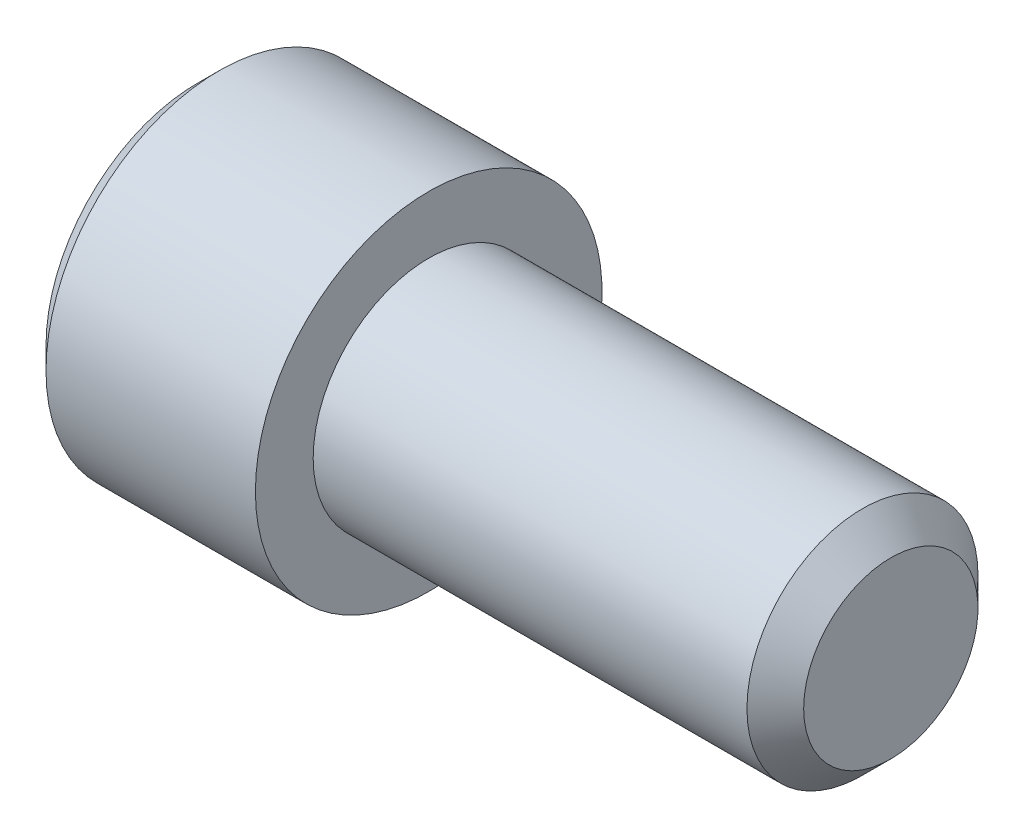
ISO-10303-21;
HEADER;
FILE_DESCRIPTION(('STEP AP214'),'2;1');
FILE_NAME('part.step','',(''),(''),'','','');
FILE_SCHEMA(('AUTOMOTIVE_DESIGN { 1 0 10303 214 1 1 1 1 }'));
ENDSEC;
DATA;
#1=APPLICATION_CONTEXT('core data for automotive mechanical design processes');
#2=APPLICATION_PROTOCOL_DEFINITION('international standard','automotive_design',2000,#1);
#3=PRODUCT_CONTEXT('',#1,'mechanical');
#4=PRODUCT('Part','Part','',(#3));
#5=PRODUCT_RELATED_PRODUCT_CATEGORY('part','',(#4));
#6=PRODUCT_DEFINITION_FORMATION('','',#4);
#7=PRODUCT_DEFINITION_CONTEXT('part definition',#1,'design');
#8=PRODUCT_DEFINITION('design','',#6,#7);
#9=PRODUCT_DEFINITION_SHAPE('','',#8);
#10=(LENGTH_UNIT() NAMED_UNIT(*) SI_UNIT(.MILLI.,.METRE.));
#11=(NAMED_UNIT(*) PLANE_ANGLE_UNIT() SI_UNIT($,.RADIAN.));
#12=(NAMED_UNIT(*) SI_UNIT($,.STERADIAN.) SOLID_ANGLE_UNIT());
#13=UNCERTAINTY_MEASURE_WITH_UNIT(LENGTH_MEASURE(1.E-05),#10,'distance_accuracy_value','');
#14=(GEOMETRIC_REPRESENTATION_CONTEXT(3) GLOBAL_UNCERTAINTY_ASSIGNED_CONTEXT((#13)) GLOBAL_UNIT_ASSIGNED_CONTEXT((#10,
#11,#12)) REPRESENTATION_CONTEXT('',''));
#15=CARTESIAN_POINT('',(0.,0.,0.));
#16=DIRECTION('',(0.,0.,1.));
#17=DIRECTION('',(1.,0.,0.));
#18=AXIS2_PLACEMENT_3D('',#15,#16,#17);
#19=CARTESIAN_POINT('',(-1.85,0.,0.));
#20=DIRECTION('',(-1.,0.,0.));
#21=DIRECTION('',(0.,0.,1.));
#22=AXIS2_PLACEMENT_3D('',#19,#20,#21);
#23=CONICAL_SURFACE('',#22,0.75,0.785398163397448);
#24=CARTESIAN_POINT('',(-2.,0.,0.));
#25=DIRECTION('',(-1.,0.,0.));
#26=DIRECTION('',(0.,0.,1.));
#27=AXIS2_PLACEMENT_3D('',#24,#25,#26);
#28=CIRCLE('',#27,0.9);
#29=CARTESIAN_POINT('',(-2.,0.,0.9));
#30=VERTEX_POINT('',#29);
#31=EDGE_CURVE('E226',#30,#30,#28,.T.);
#32=ORIENTED_EDGE('',*,*,#31,.T.);
#33=EDGE_LOOP('',(#32));
#34=FACE_BOUND('',#33,.T.);
#35=CARTESIAN_POINT('',(-1.96614089692921,0.866140873838278,-0.0002));
#36=CARTESIAN_POINT('',(-1.95125951424836,0.85125103201321,0.0255899625576815));
#37=CARTESIAN_POINT('',(-1.9372516693914,0.83611219228842,0.0518112021286592));
#38=CARTESIAN_POINT('',(-1.9116029284667,0.80524213589435,0.105279708235706));
#39=CARTESIAN_POINT('',(-1.89997631549011,0.789507978959821,0.132532067460573));
#40=CARTESIAN_POINT('',(-1.88005944955668,0.757780686272654,0.187485350381353));
#41=CARTESIAN_POINT('',(-1.87171909786581,0.741795643459148,0.21517225669551));
#42=CARTESIAN_POINT('',(-1.85886814574587,0.709473647943368,0.271155595130853));
#43=CARTESIAN_POINT('',(-1.85434794437328,0.693137683900543,0.299450314843645));
#44=CARTESIAN_POINT('',(-1.85027123688187,0.664986099540475,0.348210289268844));
#45=CARTESIAN_POINT('',(-1.84966820039852,0.653207128451651,0.368612065655573));
#46=CARTESIAN_POINT('',(-1.85067990979997,0.629671982217687,0.40937613469636));
#47=CARTESIAN_POINT('',(-1.85229514477447,0.617915812672248,0.429738417651455));
#48=CARTESIAN_POINT('',(-1.86036155075748,0.582815153286452,0.490534543086824));
#49=CARTESIAN_POINT('',(-1.87003433961216,0.559645329552699,0.530665854996099));
#50=CARTESIAN_POINT('',(-1.89338172175675,0.518974152327359,0.601110400354026));
#51=CARTESIAN_POINT('',(-1.90583396185669,0.501282308923486,0.631753572009086));
#52=CARTESIAN_POINT('',(-1.9338850140153,0.466591771248069,0.69183934580479));
#53=CARTESIAN_POINT('',(-1.94947358968819,0.449591032904757,0.721285488381591));
#54=CARTESIAN_POINT('',(-1.96614089692921,0.432897231838382,0.7502));
#55=B_SPLINE_CURVE_WITH_KNOTS('',3,(#35,#36,#37,#38,#39,#40,#41,#42,#43,#44,#45,#46,#47,#48,#49,
#50,#51,#52,#53,#54),.UNSPECIFIED.,.F.,.F.,(4,2,2,2,2,2,2,2,2,4),(0.,0.0999419466095598,
0.200466857654446,0.299393763705718,0.398071297300231,0.468665775681748,0.53927582139884,
0.680536257244566,0.792918418368074,0.904939568716032),.UNSPECIFIED.);
#56=CARTESIAN_POINT('',(-1.96602540378444,0.86602540378444,0.));
#57=VERTEX_POINT('',#56);
#58=CARTESIAN_POINT('',(-1.96602540378444,0.43301270189222,0.75));
#59=VERTEX_POINT('',#58);
#60=EDGE_CURVE('E54',#57,#59,#55,.T.);
#61=ORIENTED_EDGE('',*,*,#60,.T.);
#62=CARTESIAN_POINT('',(-2.28498450539523,-0.917435707843764,0.75));
#63=CARTESIAN_POINT('',(-2.2678667108574,-0.895322637488462,0.75));
#64=CARTESIAN_POINT('',(-2.25090072767686,-0.873092435797409,0.75));
#65=CARTESIAN_POINT('',(-2.21733662385259,-0.828348331249561,0.75));
#66=CARTESIAN_POINT('',(-2.20073858866413,-0.805834364354332,0.75));
#67=CARTESIAN_POINT('',(-2.15135585709605,-0.737463645985081,0.75));
#68=CARTESIAN_POINT('',(-2.11924462594972,-0.691112526673733,0.75));
#69=CARTESIAN_POINT('',(-2.05568682596992,-0.593551125551393,0.75));
#70=CARTESIAN_POINT('',(-2.02442165720724,-0.542221451270677,0.75));
#71=CARTESIAN_POINT('',(-1.96687568450647,-0.436934399168266,0.75));
#72=CARTESIAN_POINT('',(-1.94057804705966,-0.382986703868344,0.75));
#73=CARTESIAN_POINT('',(-1.90839074036174,-0.302507607984157,0.75));
#74=CARTESIAN_POINT('',(-1.89924982674428,-0.277284063785511,0.75));
#75=CARTESIAN_POINT('',(-1.88298812399052,-0.226180863902708,0.75));
#76=CARTESIAN_POINT('',(-1.87586746044888,-0.20030116753587,0.75));
#77=CARTESIAN_POINT('',(-1.86415365084109,-0.148504398457123,0.75));
#78=CARTESIAN_POINT('',(-1.85951333869583,-0.122598170477208,0.75));
#79=CARTESIAN_POINT('',(-1.85285693649874,-0.070440295072611,0.75));
#80=CARTESIAN_POINT('',(-1.85084110928875,-0.0441886133166744,0.75));
#81=CARTESIAN_POINT('',(-1.84961537614473,0.00715979592785976,0.75));
#82=CARTESIAN_POINT('',(-1.85027949049467,0.0322535332763837,0.75));
#83=CARTESIAN_POINT('',(-1.85408395670594,0.082242672718766,0.75));
#84=CARTESIAN_POINT('',(-1.85722369361662,0.107138122516666,0.75));
#85=CARTESIAN_POINT('',(-1.86585263917875,0.156986366361875,0.75));
#86=CARTESIAN_POINT('',(-1.87138423328569,0.181931702819942,0.75));
#87=CARTESIAN_POINT('',(-1.88448687025693,0.231269085182803,0.75));
#88=CARTESIAN_POINT('',(-1.89205781682589,0.255661157153014,0.75));
#89=CARTESIAN_POINT('',(-1.91810014054592,0.330191673605323,0.75));
#90=CARTESIAN_POINT('',(-1.93943977214851,0.379324631470661,0.75));
#91=CARTESIAN_POINT('',(-1.98693832469846,0.475298904003308,0.75));
#92=CARTESIAN_POINT('',(-2.01311412250561,0.522131443026563,0.75));
#93=CARTESIAN_POINT('',(-2.06717247921482,0.611659319459457,0.75));
#94=CARTESIAN_POINT('',(-2.09490758962535,0.654444829936083,0.75));
#95=CARTESIAN_POINT('',(-2.13780794830858,0.717480249811218,0.75));
#96=CARTESIAN_POINT('',(-2.15226421085697,0.738221190091019,0.75));
#97=CARTESIAN_POINT('',(-2.18156559351443,0.779418304292079,0.75));
#98=CARTESIAN_POINT('',(-2.19641060589534,0.799874554748216,0.75));
#99=CARTESIAN_POINT('',(-2.21141700400184,0.820212019409876,0.75));
#100=B_SPLINE_CURVE_WITH_KNOTS('',3,(#62,#63,#64,#65,#66,#67,#68,#69,#70,#71,#72,#73,#74,#75,
#76,#77,#78,#79,#80,#81,#82,#83,#84,#85,#86,#87,#88,#89,#90,#91,#92,#93,#94,#95,#96,#97,#98,
#99),.UNSPECIFIED.,.F.,.F.,(4,2,2,2,2,2,2,2,2,2,2,2,2,2,2,2,2,2,4),(0.,0.083891166922223,
0.167801617506669,0.336896584417538,0.517070724437731,0.696622901565622,0.77704232374542,
0.857466744334747,0.936301883451218,1.01514491728988,1.09032587205516,1.16548815756962,
1.24204077046884,1.31858976929581,1.47882432997554,1.63962900434597,1.79251782144892,
1.86836026980847,1.94418191901598),.UNSPECIFIED.);
#101=CARTESIAN_POINT('',(-1.96602540378444,-0.43301270189222,0.75));
#102=VERTEX_POINT('',#101);
#103=EDGE_CURVE('E196',#59,#102,#100,.F.);
#104=ORIENTED_EDGE('',*,*,#103,.T.);
#105=CARTESIAN_POINT('',(-1.96614089692921,-0.432897231838382,0.7502));
#106=CARTESIAN_POINT('',(-1.95125951424836,-0.44778707366345,0.724410037442319));
#107=CARTESIAN_POINT('',(-1.9372516693914,-0.462925913388239,0.698188797871341));
#108=CARTESIAN_POINT('',(-1.9116029284667,-0.49379596978231,0.644720291764294));
#109=CARTESIAN_POINT('',(-1.89997631549011,-0.509530126716839,0.617467932539428));
#110=CARTESIAN_POINT('',(-1.88005944955668,-0.541257419404005,0.562514649618648));
#111=CARTESIAN_POINT('',(-1.87171909786581,-0.557242462217511,0.534827743304491));
#112=CARTESIAN_POINT('',(-1.85886814574587,-0.589564457733291,0.478844404869148));
#113=CARTESIAN_POINT('',(-1.85434794437328,-0.605900421776116,0.450549685156356));
#114=CARTESIAN_POINT('',(-1.85027123688187,-0.634052006136184,0.401789710731158));
#115=CARTESIAN_POINT('',(-1.84966820039852,-0.645830977225008,0.381387934344429));
#116=CARTESIAN_POINT('',(-1.85067990979997,-0.669366123458972,0.340623865303642));
#117=CARTESIAN_POINT('',(-1.85229514477447,-0.681122293004411,0.320261582348547));
#118=CARTESIAN_POINT('',(-1.86036155075748,-0.716222952390207,0.259465456913178));
#119=CARTESIAN_POINT('',(-1.87003433961216,-0.73939277612396,0.219334145003903));
#120=CARTESIAN_POINT('',(-1.89338172175675,-0.7800639533493,0.148889599645976));
#121=CARTESIAN_POINT('',(-1.90583396185669,-0.797755796753174,0.118246427990915));
#122=CARTESIAN_POINT('',(-1.9338850140153,-0.83244633442859,0.0581606541952108));
#123=CARTESIAN_POINT('',(-1.94947358968819,-0.849447072771903,0.0287145116184096));
#124=CARTESIAN_POINT('',(-1.96614089692921,-0.866140873838278,-0.000199999999999989));
#125=B_SPLINE_CURVE_WITH_KNOTS('',3,(#105,#106,#107,#108,#109,#110,#111,#112,#113,#114,#115,
#116,#117,#118,#119,#120,#121,#122,#123,#124),.UNSPECIFIED.,.F.,.F.,(4,2,2,2,2,2,2,2,2,4),(0.,
0.0999419466095593,0.200466857654446,0.299393763705716,0.398071297300229,0.468665775681746,
0.539275821398837,0.680536257244564,0.792918418368073,0.904939568716032),.UNSPECIFIED.);
#126=CARTESIAN_POINT('',(-1.96602540378444,-0.86602540378444,0.));
#127=VERTEX_POINT('',#126);
#128=EDGE_CURVE('E140',#102,#127,#125,.T.);
#129=ORIENTED_EDGE('',*,*,#128,.T.);
#130=CARTESIAN_POINT('',(-1.96614089692921,-0.866140873838278,0.0002));
#131=CARTESIAN_POINT('',(-1.95125951424836,-0.85125103201321,-0.0255899625576815));
#132=CARTESIAN_POINT('',(-1.9372516693914,-0.83611219228842,-0.0518112021286592));
#133=CARTESIAN_POINT('',(-1.9116029284667,-0.80524213589435,-0.105279708235706));
#134=CARTESIAN_POINT('',(-1.89997631549011,-0.789507978959821,-0.132532067460573));
#135=CARTESIAN_POINT('',(-1.88005944955668,-0.757780686272654,-0.187485350381353));
#136=CARTESIAN_POINT('',(-1.87171909786581,-0.741795643459148,-0.21517225669551));
#137=CARTESIAN_POINT('',(-1.85886814574587,-0.709473647943368,-0.271155595130853));
#138=CARTESIAN_POINT('',(-1.85434794437328,-0.693137683900543,-0.299450314843645));
#139=CARTESIAN_POINT('',(-1.85027123688187,-0.664986099540475,-0.348210289268844));
#140=CARTESIAN_POINT('',(-1.84966820039852,-0.653207128451651,-0.368612065655573));
#141=CARTESIAN_POINT('',(-1.85067990979997,-0.629671982217687,-0.40937613469636));
#142=CARTESIAN_POINT('',(-1.85229514477447,-0.617915812672248,-0.429738417651455));
#143=CARTESIAN_POINT('',(-1.86036155075748,-0.582815153286452,-0.490534543086824));
#144=CARTESIAN_POINT('',(-1.87003433961216,-0.559645329552699,-0.530665854996099));
#145=CARTESIAN_POINT('',(-1.89338172175675,-0.518974152327359,-0.601110400354026));
#146=CARTESIAN_POINT('',(-1.90583396185669,-0.501282308923486,-0.631753572009086));
#147=CARTESIAN_POINT('',(-1.9338850140153,-0.466591771248069,-0.69183934580479));
#148=CARTESIAN_POINT('',(-1.94947358968819,-0.449591032904757,-0.721285488381591));
#149=CARTESIAN_POINT('',(-1.96614089692921,-0.432897231838382,-0.7502));
#150=B_SPLINE_CURVE_WITH_KNOTS('',3,(#130,#131,#132,#133,#134,#135,#136,#137,#138,#139,#140,
#141,#142,#143,#144,#145,#146,#147,#148,#149),.UNSPECIFIED.,.F.,.F.,(4,2,2,2,2,2,2,2,2,4),(0.,
0.0999419466095598,0.200466857654446,0.299393763705718,0.398071297300231,0.468665775681748,
0.53927582139884,0.680536257244566,0.792918418368074,0.904939568716032),.UNSPECIFIED.);
#151=CARTESIAN_POINT('',(-1.96602540378444,-0.43301270189222,-0.75));
#152=VERTEX_POINT('',#151);
#153=EDGE_CURVE('E187',#127,#152,#150,.T.);
#154=ORIENTED_EDGE('',*,*,#153,.T.);
#155=CARTESIAN_POINT('',(-2.28498450539523,-0.917435707843764,-0.75));
#156=CARTESIAN_POINT('',(-2.2678667108574,-0.895322637488462,-0.75));
#157=CARTESIAN_POINT('',(-2.25090072767686,-0.873092435797409,-0.75));
#158=CARTESIAN_POINT('',(-2.21733662385259,-0.828348331249561,-0.75));
#159=CARTESIAN_POINT('',(-2.20073858866413,-0.805834364354332,-0.75));
#160=CARTESIAN_POINT('',(-2.15135585709605,-0.737463645985081,-0.75));
#161=CARTESIAN_POINT('',(-2.11924462594972,-0.691112526673733,-0.75));
#162=CARTESIAN_POINT('',(-2.05568682596992,-0.593551125551393,-0.75));
#163=CARTESIAN_POINT('',(-2.02442165720724,-0.542221451270677,-0.75));
#164=CARTESIAN_POINT('',(-1.96687568450647,-0.436934399168266,-0.75));
#165=CARTESIAN_POINT('',(-1.94057804705966,-0.382986703868344,-0.75));
#166=CARTESIAN_POINT('',(-1.90839074036174,-0.302507607984157,-0.75));
#167=CARTESIAN_POINT('',(-1.89924982674428,-0.277284063785511,-0.75));
#168=CARTESIAN_POINT('',(-1.88298812399052,-0.226180863902708,-0.75));
#169=CARTESIAN_POINT('',(-1.87586746044888,-0.20030116753587,-0.75));
#170=CARTESIAN_POINT('',(-1.86415365084109,-0.148504398457123,-0.75));
#171=CARTESIAN_POINT('',(-1.85951333869583,-0.122598170477208,-0.75));
#172=CARTESIAN_POINT('',(-1.85285693649874,-0.070440295072611,-0.75));
#173=CARTESIAN_POINT('',(-1.85084110928875,-0.0441886133166744,-0.75));
#174=CARTESIAN_POINT('',(-1.84961537614473,0.00715979592785976,-0.75));
#175=CARTESIAN_POINT('',(-1.85027949049467,0.0322535332763837,-0.75));
#176=CARTESIAN_POINT('',(-1.85408395670594,0.082242672718766,-0.75));
#177=CARTESIAN_POINT('',(-1.85722369361662,0.107138122516666,-0.75));
#178=CARTESIAN_POINT('',(-1.86585263917875,0.156986366361875,-0.75));
#179=CARTESIAN_POINT('',(-1.87138423328569,0.181931702819942,-0.75));
#180=CARTESIAN_POINT('',(-1.88448687025693,0.231269085182803,-0.75));
#181=CARTESIAN_POINT('',(-1.89205781682589,0.255661157153014,-0.75));
#182=CARTESIAN_POINT('',(-1.91810014054592,0.330191673605323,-0.75));
#183=CARTESIAN_POINT('',(-1.93943977214851,0.379324631470661,-0.75));
#184=CARTESIAN_POINT('',(-1.98693832469846,0.475298904003308,-0.75));
#185=CARTESIAN_POINT('',(-2.01311412250561,0.522131443026563,-0.75));
#186=CARTESIAN_POINT('',(-2.06717247921482,0.611659319459457,-0.75));
#187=CARTESIAN_POINT('',(-2.09490758962535,0.654444829936083,-0.75));
#188=CARTESIAN_POINT('',(-2.13780794830858,0.717480249811218,-0.75));
#189=CARTESIAN_POINT('',(-2.15226421085697,0.738221190091019,-0.75));
#190=CARTESIAN_POINT('',(-2.18156559351443,0.779418304292079,-0.75));
#191=CARTESIAN_POINT('',(-2.19641060589534,0.799874554748216,-0.75));
#192=CARTESIAN_POINT('',(-2.21141700400184,0.820212019409876,-0.75));
#193=B_SPLINE_CURVE_WITH_KNOTS('',3,(#155,#156,#157,#158,#159,#160,#161,#162,#163,#164,#165,
#166,#167,#168,#169,#170,#171,#172,#173,#174,#175,#176,#177,#178,#179,#180,#181,#182,#183,#184,
#185,#186,#187,#188,#189,#190,#191,#192),.UNSPECIFIED.,.F.,.F.,(4,2,2,2,2,2,2,2,2,2,2,2,2,2,2,2,
2,2,4),(0.,0.083891166922223,0.167801617506669,0.336896584417538,0.517070724437731,
0.696622901565622,0.77704232374542,0.857466744334747,0.936301883451218,1.01514491728988,
1.09032587205516,1.16548815756962,1.24204077046884,1.31858976929581,1.47882432997554,
1.63962900434597,1.79251782144892,1.86836026980847,1.94418191901598),.UNSPECIFIED.);
#194=CARTESIAN_POINT('',(-1.96602540378444,0.43301270189222,-0.75));
#195=VERTEX_POINT('',#194);
#196=EDGE_CURVE('E182',#152,#195,#193,.T.);
#197=ORIENTED_EDGE('',*,*,#196,.T.);
#198=CARTESIAN_POINT('',(-1.96614089692921,0.432897231838382,-0.7502));
#199=CARTESIAN_POINT('',(-1.95125951424836,0.44778707366345,-0.724410037442319));
#200=CARTESIAN_POINT('',(-1.9372516693914,0.462925913388239,-0.698188797871341));
#201=CARTESIAN_POINT('',(-1.9116029284667,0.49379596978231,-0.644720291764294));
#202=CARTESIAN_POINT('',(-1.89997631549011,0.509530126716839,-0.617467932539428));
#203=CARTESIAN_POINT('',(-1.88005944955668,0.541257419404005,-0.562514649618648));
#204=CARTESIAN_POINT('',(-1.87171909786581,0.557242462217511,-0.534827743304491));
#205=CARTESIAN_POINT('',(-1.85886814574587,0.589564457733291,-0.478844404869148));
#206=CARTESIAN_POINT('',(-1.85434794437328,0.605900421776116,-0.450549685156356));
#207=CARTESIAN_POINT('',(-1.85027123688187,0.634052006136184,-0.401789710731158));
#208=CARTESIAN_POINT('',(-1.84966820039852,0.645830977225008,-0.381387934344429));
#209=CARTESIAN_POINT('',(-1.85067990979997,0.669366123458972,-0.340623865303642));
#210=CARTESIAN_POINT('',(-1.85229514477447,0.681122293004411,-0.320261582348547));
#211=CARTESIAN_POINT('',(-1.86036155075748,0.716222952390207,-0.259465456913178));
#212=CARTESIAN_POINT('',(-1.87003433961216,0.73939277612396,-0.219334145003903));
#213=CARTESIAN_POINT('',(-1.89338172175675,0.7800639533493,-0.148889599645976));
#214=CARTESIAN_POINT('',(-1.90583396185669,0.797755796753174,-0.118246427990915));
#215=CARTESIAN_POINT('',(-1.9338850140153,0.83244633442859,-0.0581606541952108));
#216=CARTESIAN_POINT('',(-1.94947358968819,0.849447072771903,-0.0287145116184096));
#217=CARTESIAN_POINT('',(-1.96614089692921,0.866140873838278,0.000199999999999989));
#218=B_SPLINE_CURVE_WITH_KNOTS('',3,(#198,#199,#200,#201,#202,#203,#204,#205,#206,#207,#208,
#209,#210,#211,#212,#213,#214,#215,#216,#217),.UNSPECIFIED.,.F.,.F.,(4,2,2,2,2,2,2,2,2,4),(0.,
0.0999419466095593,0.200466857654446,0.299393763705716,0.398071297300229,0.468665775681746,
0.539275821398837,0.680536257244564,0.792918418368073,0.904939568716032),.UNSPECIFIED.);
#219=EDGE_CURVE('E143',#195,#57,#218,.T.);
#220=ORIENTED_EDGE('',*,*,#219,.T.);
#221=EDGE_LOOP('',(#61,#104,#129,#154,#197,#220));
#222=FACE_BOUND('',#221,.T.);
#223=ADVANCED_FACE('F39',(#34,#222),#23,.F.);
#224=CARTESIAN_POINT('',(-2.,0.,0.));
#225=DIRECTION('',(1.,0.,0.));
#226=DIRECTION('',(0.,0.,-1.));
#227=AXIS2_PLACEMENT_3D('',#224,#225,#226);
#228=PLANE('',#227);
#229=CARTESIAN_POINT('',(-2.,0.,0.));
#230=DIRECTION('',(-1.,0.,0.));
#231=DIRECTION('',(0.,0.,1.));
#232=AXIS2_PLACEMENT_3D('',#229,#230,#231);
#233=CIRCLE('',#232,1.3125);
#234=CARTESIAN_POINT('',(-2.,0.,1.3125));
#235=VERTEX_POINT('',#234);
#236=EDGE_CURVE('E11',#235,#235,#233,.T.);
#237=ORIENTED_EDGE('',*,*,#236,.T.);
#238=EDGE_LOOP('',(#237));
#239=FACE_BOUND('',#238,.T.);
#240=ORIENTED_EDGE('',*,*,#31,.F.);
#241=EDGE_LOOP('',(#240));
#242=FACE_BOUND('',#241,.T.);
#243=ADVANCED_FACE('F41',(#239,#242),#228,.F.);
#244=CARTESIAN_POINT('',(-1.8125,0.,0.));
#245=DIRECTION('',(1.,0.,0.));
#246=DIRECTION('',(0.,0.,-1.));
#247=AXIS2_PLACEMENT_3D('',#244,#245,#246);
#248=CONICAL_SURFACE('',#247,1.5,0.785398163397448);
#249=ORIENTED_EDGE('',*,*,#236,.F.);
#250=EDGE_LOOP('',(#249));
#251=FACE_BOUND('',#250,.T.);
#252=CARTESIAN_POINT('',(-1.8125,0.,0.));
#253=DIRECTION('',(-1.,0.,0.));
#254=DIRECTION('',(0.,0.,1.));
#255=AXIS2_PLACEMENT_3D('',#252,#253,#254);
#256=CIRCLE('',#255,1.5);
#257=CARTESIAN_POINT('',(-1.8125,0.,1.5));
#258=VERTEX_POINT('',#257);
#259=EDGE_CURVE('E47',#258,#258,#256,.T.);
#260=ORIENTED_EDGE('',*,*,#259,.T.);
#261=EDGE_LOOP('',(#260));
#262=FACE_BOUND('',#261,.T.);
#263=ADVANCED_FACE('F222',(#251,#262),#248,.T.);
#264=CARTESIAN_POINT('',(4.,0.,0.));
#265=DIRECTION('',(-1.,0.,0.));
#266=DIRECTION('',(0.,0.,1.));
#267=AXIS2_PLACEMENT_3D('',#264,#265,#266);
#268=CYLINDRICAL_SURFACE('',#267,1.5);
#269=ORIENTED_EDGE('',*,*,#259,.F.);
#270=EDGE_LOOP('',(#269));
#271=FACE_BOUND('',#270,.T.);
#272=CARTESIAN_POINT('',(0.,0.,0.));
#273=DIRECTION('',(-1.,0.,0.));
#274=DIRECTION('',(0.,0.,1.));
#275=AXIS2_PLACEMENT_3D('',#272,#273,#274);
#276=CIRCLE('',#275,1.5);
#277=CARTESIAN_POINT('',(0.,0.,1.5));
#278=VERTEX_POINT('',#277);
#279=EDGE_CURVE('E241',#278,#278,#276,.T.);
#280=ORIENTED_EDGE('',*,*,#279,.T.);
#281=EDGE_LOOP('',(#280));
#282=FACE_BOUND('',#281,.T.);
#283=ADVANCED_FACE('F247',(#271,#282),#268,.T.);
#284=CARTESIAN_POINT('',(0.,1.5,0.));
#285=DIRECTION('',(-1.,0.,0.));
#286=DIRECTION('',(0.,0.,1.));
#287=AXIS2_PLACEMENT_3D('',#284,#285,#286);
#288=PLANE('',#287);
#289=ORIENTED_EDGE('',*,*,#279,.F.);
#290=EDGE_LOOP('',(#289));
#291=FACE_BOUND('',#290,.T.);
#292=CARTESIAN_POINT('',(0.,0.,0.));
#293=DIRECTION('',(-1.,0.,0.));
#294=DIRECTION('',(0.,0.,1.));
#295=AXIS2_PLACEMENT_3D('',#292,#293,#294);
#296=CIRCLE('',#295,1.);
#297=CARTESIAN_POINT('',(0.,0.,1.));
#298=VERTEX_POINT('',#297);
#299=EDGE_CURVE('E238',#298,#298,#296,.T.);
#300=ORIENTED_EDGE('',*,*,#299,.T.);
#301=EDGE_LOOP('',(#300));
#302=FACE_BOUND('',#301,.T.);
#303=ADVANCED_FACE('F250',(#291,#302),#288,.F.);
#304=CARTESIAN_POINT('',(4.,0.,0.));
#305=DIRECTION('',(-1.,0.,0.));
#306=DIRECTION('',(0.,0.,1.));
#307=AXIS2_PLACEMENT_3D('',#304,#305,#306);
#308=CYLINDRICAL_SURFACE('',#307,1.);
#309=ORIENTED_EDGE('',*,*,#299,.F.);
#310=EDGE_LOOP('',(#309));
#311=FACE_BOUND('',#310,.T.);
#312=CARTESIAN_POINT('',(3.7545,0.,0.));
#313=DIRECTION('',(-1.,0.,0.));
#314=DIRECTION('',(0.,0.,1.));
#315=AXIS2_PLACEMENT_3D('',#312,#313,#314);
#316=CIRCLE('',#315,1.);
#317=CARTESIAN_POINT('',(3.7545,0.,1.));
#318=VERTEX_POINT('',#317);
#319=EDGE_CURVE('E232',#318,#318,#316,.T.);
#320=ORIENTED_EDGE('',*,*,#319,.T.);
#321=EDGE_LOOP('',(#320));
#322=FACE_BOUND('',#321,.T.);
#323=ADVANCED_FACE('F256',(#311,#322),#308,.T.);
#324=CARTESIAN_POINT('',(4.,0.,0.));
#325=DIRECTION('',(-1.,0.,0.));
#326=DIRECTION('',(0.,0.,1.));
#327=AXIS2_PLACEMENT_3D('',#324,#325,#326);
#328=CONICAL_SURFACE('',#327,0.7545,0.785398163397448);
#329=ORIENTED_EDGE('',*,*,#319,.F.);
#330=EDGE_LOOP('',(#329));
#331=FACE_BOUND('',#330,.T.);
#332=CARTESIAN_POINT('',(4.,0.,0.));
#333=DIRECTION('',(-1.,0.,0.));
#334=DIRECTION('',(0.,0.,1.));
#335=AXIS2_PLACEMENT_3D('',#332,#333,#334);
#336=CIRCLE('',#335,0.7545);
#337=CARTESIAN_POINT('',(4.,0.,0.7545));
#338=VERTEX_POINT('',#337);
#339=EDGE_CURVE('E228',#338,#338,#336,.T.);
#340=ORIENTED_EDGE('',*,*,#339,.T.);
#341=EDGE_LOOP('',(#340));
#342=FACE_BOUND('',#341,.T.);
#343=ADVANCED_FACE('F262',(#331,#342),#328,.T.);
#344=CARTESIAN_POINT('',(4.,0.7545,0.));
#345=DIRECTION('',(-1.,0.,0.));
#346=DIRECTION('',(0.,0.,1.));
#347=AXIS2_PLACEMENT_3D('',#344,#345,#346);
#348=PLANE('',#347);
#349=ORIENTED_EDGE('',*,*,#339,.F.);
#350=EDGE_LOOP('',(#349));
#351=FACE_BOUND('',#350,.T.);
#352=ADVANCED_FACE('F206',(#351),#348,.F.);
#353=CARTESIAN_POINT('',(-1.,0.43301270189222,0.75));
#354=DIRECTION('',(0.,0.,-1.));
#355=DIRECTION('',(-1.,0.,0.));
#356=AXIS2_PLACEMENT_3D('',#353,#354,#355);
#357=PLANE('',#356);
#358=DIRECTION('',(-1.,0.,0.));
#359=VECTOR('',#358,1.);
#360=CARTESIAN_POINT('',(-1.,0.43301270189222,0.75));
#361=LINE('',#360,#359);
#362=CARTESIAN_POINT('',(-1.,0.43301270189222,0.75));
#363=VERTEX_POINT('',#362);
#364=EDGE_CURVE('E426',#363,#59,#361,.T.);
#365=ORIENTED_EDGE('',*,*,#364,.F.);
#366=DIRECTION('',(0.,-1.,0.));
#367=VECTOR('',#366,1.);
#368=CARTESIAN_POINT('',(-1.,0.43301270189222,0.75));
#369=LINE('',#368,#367);
#370=CARTESIAN_POINT('',(-1.,0.,0.75));
#371=VERTEX_POINT('',#370);
#372=EDGE_CURVE('E123',#363,#371,#369,.T.);
#373=ORIENTED_EDGE('',*,*,#372,.T.);
#374=CARTESIAN_POINT('',(-1.,-0.43301270189222,0.75));
#375=VERTEX_POINT('',#374);
#376=EDGE_CURVE('E115',#371,#375,#369,.T.);
#377=ORIENTED_EDGE('',*,*,#376,.T.);
#378=DIRECTION('',(-1.,0.,0.));
#379=VECTOR('',#378,1.);
#380=CARTESIAN_POINT('',(-1.,-0.43301270189222,0.75));
#381=LINE('',#380,#379);
#382=EDGE_CURVE('E121',#375,#102,#381,.T.);
#383=ORIENTED_EDGE('',*,*,#382,.T.);
#384=ORIENTED_EDGE('',*,*,#103,.F.);
#385=EDGE_LOOP('',(#365,#373,#377,#383,#384));
#386=FACE_BOUND('',#385,.T.);
#387=ADVANCED_FACE('F118',(#386),#357,.T.);
#388=CARTESIAN_POINT('',(-1.,-0.43301270189222,0.75));
#389=DIRECTION('',(0.,0.866025403784438,-0.500000000000001));
#390=DIRECTION('',(0.,0.500000000000001,0.866025403784438));
#391=AXIS2_PLACEMENT_3D('',#388,#389,#390);
#392=PLANE('',#391);
#393=ORIENTED_EDGE('',*,*,#382,.F.);
#394=DIRECTION('',(0.,-0.500000000000001,-0.866025403784438));
#395=VECTOR('',#394,1.);
#396=CARTESIAN_POINT('',(-1.,-0.43301270189222,0.75));
#397=LINE('',#396,#395);
#398=CARTESIAN_POINT('',(-1.,-0.64951905283833,0.375000000000001));
#399=VERTEX_POINT('',#398);
#400=EDGE_CURVE('E128',#375,#399,#397,.T.);
#401=ORIENTED_EDGE('',*,*,#400,.T.);
#402=CARTESIAN_POINT('',(-1.,-0.86602540378444,0.));
#403=VERTEX_POINT('',#402);
#404=EDGE_CURVE('E135',#399,#403,#397,.T.);
#405=ORIENTED_EDGE('',*,*,#404,.T.);
#406=DIRECTION('',(-1.,0.,0.));
#407=VECTOR('',#406,1.);
#408=CARTESIAN_POINT('',(-1.,-0.86602540378444,0.));
#409=LINE('',#408,#407);
#410=EDGE_CURVE('E141',#403,#127,#409,.T.);
#411=ORIENTED_EDGE('',*,*,#410,.T.);
#412=ORIENTED_EDGE('',*,*,#128,.F.);
#413=EDGE_LOOP('',(#393,#401,#405,#411,#412));
#414=FACE_BOUND('',#413,.T.);
#415=ADVANCED_FACE('F138',(#414),#392,.T.);
#416=CARTESIAN_POINT('',(-1.,-0.86602540378444,0.));
#417=DIRECTION('',(0.,0.866025403784438,0.500000000000001));
#418=DIRECTION('',(0.,-0.500000000000001,0.866025403784438));
#419=AXIS2_PLACEMENT_3D('',#416,#417,#418);
#420=PLANE('',#419);
#421=ORIENTED_EDGE('',*,*,#410,.F.);
#422=DIRECTION('',(0.,0.500000000000001,-0.866025403784438));
#423=VECTOR('',#422,1.);
#424=CARTESIAN_POINT('',(-1.,-0.86602540378444,0.));
#425=LINE('',#424,#423);
#426=CARTESIAN_POINT('',(-1.,-0.649519052838329,-0.375));
#427=VERTEX_POINT('',#426);
#428=EDGE_CURVE('E62',#403,#427,#425,.T.);
#429=ORIENTED_EDGE('',*,*,#428,.T.);
#430=CARTESIAN_POINT('',(-1.,-0.43301270189222,-0.75));
#431=VERTEX_POINT('',#430);
#432=EDGE_CURVE('E134',#427,#431,#425,.T.);
#433=ORIENTED_EDGE('',*,*,#432,.T.);
#434=DIRECTION('',(-1.,0.,0.));
#435=VECTOR('',#434,1.);
#436=CARTESIAN_POINT('',(-1.,-0.43301270189222,-0.75));
#437=LINE('',#436,#435);
#438=EDGE_CURVE('E145',#431,#152,#437,.T.);
#439=ORIENTED_EDGE('',*,*,#438,.T.);
#440=ORIENTED_EDGE('',*,*,#153,.F.);
#441=EDGE_LOOP('',(#421,#429,#433,#439,#440));
#442=FACE_BOUND('',#441,.T.);
#443=ADVANCED_FACE('F178',(#442),#420,.T.);
#444=CARTESIAN_POINT('',(-1.,-0.43301270189222,-0.75));
#445=DIRECTION('',(0.,0.,1.));
#446=DIRECTION('',(1.,0.,0.));
#447=AXIS2_PLACEMENT_3D('',#444,#445,#446);
#448=PLANE('',#447);
#449=ORIENTED_EDGE('',*,*,#438,.F.);
#450=DIRECTION('',(0.,1.,0.));
#451=VECTOR('',#450,1.);
#452=CARTESIAN_POINT('',(-1.,-0.43301270189222,-0.75));
#453=LINE('',#452,#451);
#454=CARTESIAN_POINT('',(-1.,0.,-0.75));
#455=VERTEX_POINT('',#454);
#456=EDGE_CURVE('E439',#431,#455,#453,.T.);
#457=ORIENTED_EDGE('',*,*,#456,.T.);
#458=CARTESIAN_POINT('',(-1.,0.43301270189222,-0.75));
#459=VERTEX_POINT('',#458);
#460=EDGE_CURVE('E440',#455,#459,#453,.T.);
#461=ORIENTED_EDGE('',*,*,#460,.T.);
#462=DIRECTION('',(-1.,0.,0.));
#463=VECTOR('',#462,1.);
#464=CARTESIAN_POINT('',(-1.,0.43301270189222,-0.75));
#465=LINE('',#464,#463);
#466=EDGE_CURVE('E432',#459,#195,#465,.T.);
#467=ORIENTED_EDGE('',*,*,#466,.T.);
#468=ORIENTED_EDGE('',*,*,#196,.F.);
#469=EDGE_LOOP('',(#449,#457,#461,#467,#468));
#470=FACE_BOUND('',#469,.T.);
#471=ADVANCED_FACE('F173',(#470),#448,.T.);
#472=CARTESIAN_POINT('',(-1.,0.43301270189222,-0.75));
#473=DIRECTION('',(0.,-0.866025403784438,0.500000000000001));
#474=DIRECTION('',(0.,-0.500000000000001,-0.866025403784438));
#475=AXIS2_PLACEMENT_3D('',#472,#473,#474);
#476=PLANE('',#475);
#477=ORIENTED_EDGE('',*,*,#466,.F.);
#478=DIRECTION('',(0.,0.500000000000001,0.866025403784438));
#479=VECTOR('',#478,1.);
#480=CARTESIAN_POINT('',(-1.,0.43301270189222,-0.75));
#481=LINE('',#480,#479);
#482=CARTESIAN_POINT('',(-1.,0.64951905283833,-0.375000000000001));
#483=VERTEX_POINT('',#482);
#484=EDGE_CURVE('E421',#459,#483,#481,.T.);
#485=ORIENTED_EDGE('',*,*,#484,.T.);
#486=CARTESIAN_POINT('',(-1.,0.86602540378444,0.));
#487=VERTEX_POINT('',#486);
#488=EDGE_CURVE('E418',#483,#487,#481,.T.);
#489=ORIENTED_EDGE('',*,*,#488,.T.);
#490=DIRECTION('',(-1.,0.,0.));
#491=VECTOR('',#490,1.);
#492=CARTESIAN_POINT('',(-1.,0.86602540378444,0.));
#493=LINE('',#492,#491);
#494=EDGE_CURVE('E425',#487,#57,#493,.T.);
#495=ORIENTED_EDGE('',*,*,#494,.T.);
#496=ORIENTED_EDGE('',*,*,#219,.F.);
#497=EDGE_LOOP('',(#477,#485,#489,#495,#496));
#498=FACE_BOUND('',#497,.T.);
#499=ADVANCED_FACE('F167',(#498),#476,.T.);
#500=CARTESIAN_POINT('',(-1.,0.86602540378444,0.));
#501=DIRECTION('',(0.,-0.866025403784438,-0.500000000000001));
#502=DIRECTION('',(0.,0.500000000000001,-0.866025403784438));
#503=AXIS2_PLACEMENT_3D('',#500,#501,#502);
#504=PLANE('',#503);
#505=ORIENTED_EDGE('',*,*,#494,.F.);
#506=DIRECTION('',(0.,-0.500000000000001,0.866025403784438));
#507=VECTOR('',#506,1.);
#508=CARTESIAN_POINT('',(-1.,0.86602540378444,0.));
#509=LINE('',#508,#507);
#510=CARTESIAN_POINT('',(-1.,0.64951905283833,0.375000000000001));
#511=VERTEX_POINT('',#510);
#512=EDGE_CURVE('E417',#487,#511,#509,.T.);
#513=ORIENTED_EDGE('',*,*,#512,.T.);
#514=EDGE_CURVE('E420',#511,#363,#509,.T.);
#515=ORIENTED_EDGE('',*,*,#514,.T.);
#516=ORIENTED_EDGE('',*,*,#364,.T.);
#517=ORIENTED_EDGE('',*,*,#60,.F.);
#518=EDGE_LOOP('',(#505,#513,#515,#516,#517));
#519=FACE_BOUND('',#518,.T.);
#520=ADVANCED_FACE('F162',(#519),#504,.T.);
#521=CARTESIAN_POINT('',(-1.,0.,0.));
#522=DIRECTION('',(1.,0.,0.));
#523=DIRECTION('',(0.,0.,-1.));
#524=AXIS2_PLACEMENT_3D('',#521,#522,#523);
#525=PLANE('',#524);
#526=CARTESIAN_POINT('',(-1.,0.,0.));
#527=DIRECTION('',(-1.,0.,0.));
#528=DIRECTION('',(0.,0.,1.));
#529=AXIS2_PLACEMENT_3D('',#526,#527,#528);
#530=CIRCLE('',#529,0.75);
#531=EDGE_CURVE('E410',#483,#455,#530,.T.);
#532=ORIENTED_EDGE('',*,*,#531,.F.);
#533=ORIENTED_EDGE('',*,*,#484,.F.);
#534=ORIENTED_EDGE('',*,*,#460,.F.);
#535=EDGE_LOOP('',(#532,#533,#534));
#536=FACE_BOUND('',#535,.T.);
#537=ADVANCED_FACE('F166',(#536),#525,.F.);
#538=EDGE_CURVE('E234',#511,#483,#530,.T.);
#539=ORIENTED_EDGE('',*,*,#538,.F.);
#540=ORIENTED_EDGE('',*,*,#512,.F.);
#541=ORIENTED_EDGE('',*,*,#488,.F.);
#542=EDGE_LOOP('',(#539,#540,#541));
#543=FACE_BOUND('',#542,.T.);
#544=ADVANCED_FACE('F359',(#543),#525,.F.);
#545=EDGE_CURVE('E229',#371,#511,#530,.T.);
#546=ORIENTED_EDGE('',*,*,#545,.F.);
#547=ORIENTED_EDGE('',*,*,#372,.F.);
#548=ORIENTED_EDGE('',*,*,#514,.F.);
#549=EDGE_LOOP('',(#546,#547,#548));
#550=FACE_BOUND('',#549,.T.);
#551=ADVANCED_FACE('F368',(#550),#525,.F.);
#552=EDGE_CURVE('E130',#399,#371,#530,.T.);
#553=ORIENTED_EDGE('',*,*,#552,.F.);
#554=ORIENTED_EDGE('',*,*,#400,.F.);
#555=ORIENTED_EDGE('',*,*,#376,.F.);
#556=EDGE_LOOP('',(#553,#554,#555));
#557=FACE_BOUND('',#556,.T.);
#558=ADVANCED_FACE('F129',(#557),#525,.F.);
#559=EDGE_CURVE('E405',#427,#399,#530,.T.);
#560=ORIENTED_EDGE('',*,*,#559,.F.);
#561=ORIENTED_EDGE('',*,*,#428,.F.);
#562=ORIENTED_EDGE('',*,*,#404,.F.);
#563=EDGE_LOOP('',(#560,#561,#562));
#564=FACE_BOUND('',#563,.T.);
#565=ADVANCED_FACE('F213',(#564),#525,.F.);
#566=EDGE_CURVE('E407',#455,#427,#530,.T.);
#567=ORIENTED_EDGE('',*,*,#566,.F.);
#568=ORIENTED_EDGE('',*,*,#456,.F.);
#569=ORIENTED_EDGE('',*,*,#432,.F.);
#570=EDGE_LOOP('',(#567,#568,#569));
#571=FACE_BOUND('',#570,.T.);
#572=ADVANCED_FACE('F169',(#571),#525,.F.);
#573=CARTESIAN_POINT('',(-0.6,0.,0.));
#574=DIRECTION('',(-1.,0.,0.));
#575=DIRECTION('',(0.,0.,1.));
#576=AXIS2_PLACEMENT_3D('',#573,#574,#575);
#577=CONICAL_SURFACE('',#576,0.,1.08083900054117);
#578=ORIENTED_EDGE('',*,*,#545,.T.);
#579=ORIENTED_EDGE('',*,*,#538,.T.);
#580=ORIENTED_EDGE('',*,*,#531,.T.);
#581=ORIENTED_EDGE('',*,*,#566,.T.);
#582=ORIENTED_EDGE('',*,*,#559,.T.);
#583=ORIENTED_EDGE('',*,*,#552,.T.);
#584=EDGE_LOOP('',(#578,#579,#580,#581,#582,#583));
#585=FACE_BOUND('',#584,.T.);
#586=CARTESIAN_POINT('',(-0.6,0.,0.));
#587=VERTEX_POINT('',#586);
#588=VERTEX_LOOP('',#587);
#589=FACE_BOUND('',#588,.T.);
#590=ADVANCED_FACE('F207',(#585,#589),#577,.F.);
#591=CLOSED_SHELL('',(#223,#243,#263,#283,#303,#323,#343,#352,#387,#415,#443,#471,#499,#520,
#537,#544,#551,#558,#565,#572,#590));
#592=MANIFOLD_SOLID_BREP('B2',#591);
#593=ADVANCED_BREP_SHAPE_REPRESENTATION('',(#18,#592),#14);
#594=SHAPE_DEFINITION_REPRESENTATION(#9,#593);
ENDSEC;
END-ISO-10303-21;
